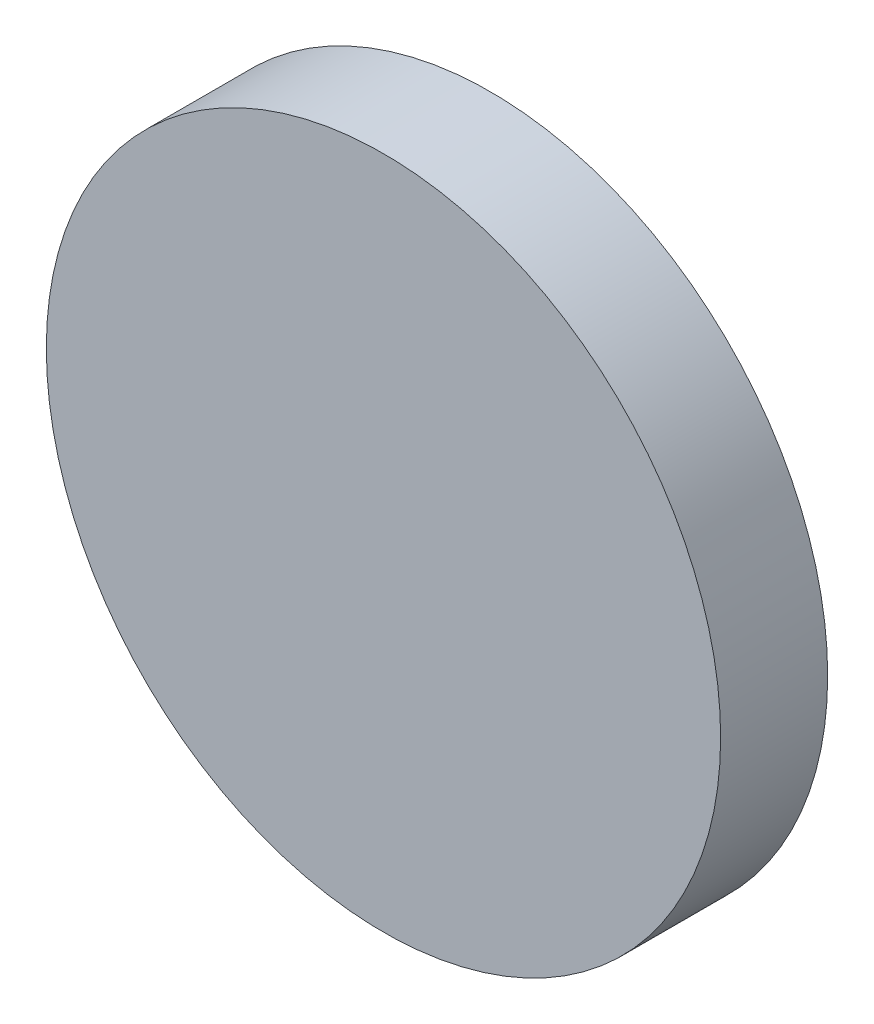
ISO-10303-21;
HEADER;
FILE_DESCRIPTION(('STEP AP214'),'2;1');
FILE_NAME('part.step','',(''),(''),'','','');
FILE_SCHEMA(('AUTOMOTIVE_DESIGN { 1 0 10303 214 1 1 1 1 }'));
ENDSEC;
DATA;
#1=APPLICATION_CONTEXT('core data for automotive mechanical design processes');
#2=APPLICATION_PROTOCOL_DEFINITION('international standard','automotive_design',2000,#1);
#3=PRODUCT_CONTEXT('',#1,'mechanical');
#4=PRODUCT('Part','Part','',(#3));
#5=PRODUCT_RELATED_PRODUCT_CATEGORY('part','',(#4));
#6=PRODUCT_DEFINITION_FORMATION('','',#4);
#7=PRODUCT_DEFINITION_CONTEXT('part definition',#1,'design');
#8=PRODUCT_DEFINITION('design','',#6,#7);
#9=PRODUCT_DEFINITION_SHAPE('','',#8);
#10=(LENGTH_UNIT() NAMED_UNIT(*) SI_UNIT(.MILLI.,.METRE.));
#11=(NAMED_UNIT(*) PLANE_ANGLE_UNIT() SI_UNIT($,.RADIAN.));
#12=(NAMED_UNIT(*) SI_UNIT($,.STERADIAN.) SOLID_ANGLE_UNIT());
#13=UNCERTAINTY_MEASURE_WITH_UNIT(LENGTH_MEASURE(1.E-05),#10,'distance_accuracy_value','');
#14=(GEOMETRIC_REPRESENTATION_CONTEXT(3) GLOBAL_UNCERTAINTY_ASSIGNED_CONTEXT((#13)) GLOBAL_UNIT_ASSIGNED_CONTEXT((#10,
#11,#12)) REPRESENTATION_CONTEXT('',''));
#15=CARTESIAN_POINT('',(0.,0.,0.));
#16=DIRECTION('',(0.,0.,1.));
#17=DIRECTION('',(1.,0.,0.));
#18=AXIS2_PLACEMENT_3D('',#15,#16,#17);
#19=CARTESIAN_POINT('',(0.,0.,1.));
#20=DIRECTION('',(0.,0.,-1.));
#21=DIRECTION('',(-1.,0.,0.));
#22=AXIS2_PLACEMENT_3D('',#19,#20,#21);
#23=CYLINDRICAL_SURFACE('',#22,3.15);
#24=CARTESIAN_POINT('',(0.,0.,1.));
#25=DIRECTION('',(0.,0.,1.));
#26=DIRECTION('',(1.,0.,0.));
#27=AXIS2_PLACEMENT_3D('',#24,#25,#26);
#28=CIRCLE('',#27,3.15);
#29=CARTESIAN_POINT('',(3.15,0.,1.));
#30=VERTEX_POINT('',#29);
#31=EDGE_CURVE('E10',#30,#30,#28,.T.);
#32=ORIENTED_EDGE('',*,*,#31,.F.);
#33=EDGE_LOOP('',(#32));
#34=FACE_BOUND('',#33,.T.);
#35=CARTESIAN_POINT('',(0.,0.,0.));
#36=DIRECTION('',(0.,0.,1.));
#37=DIRECTION('',(1.,0.,0.));
#38=AXIS2_PLACEMENT_3D('',#35,#36,#37);
#39=CIRCLE('',#38,3.15);
#40=CARTESIAN_POINT('',(3.15,0.,0.));
#41=VERTEX_POINT('',#40);
#42=EDGE_CURVE('E38',#41,#41,#39,.T.);
#43=ORIENTED_EDGE('',*,*,#42,.T.);
#44=EDGE_LOOP('',(#43));
#45=FACE_BOUND('',#44,.T.);
#46=ADVANCED_FACE('F35',(#34,#45),#23,.T.);
#47=CARTESIAN_POINT('',(0.,0.,1.));
#48=DIRECTION('',(0.,0.,1.));
#49=DIRECTION('',(1.,0.,0.));
#50=AXIS2_PLACEMENT_3D('',#47,#48,#49);
#51=PLANE('',#50);
#52=ORIENTED_EDGE('',*,*,#31,.T.);
#53=EDGE_LOOP('',(#52));
#54=FACE_BOUND('',#53,.T.);
#55=ADVANCED_FACE('F50',(#54),#51,.T.);
#56=CARTESIAN_POINT('',(0.,0.,0.));
#57=DIRECTION('',(0.,0.,1.));
#58=DIRECTION('',(1.,0.,0.));
#59=AXIS2_PLACEMENT_3D('',#56,#57,#58);
#60=PLANE('',#59);
#61=ORIENTED_EDGE('',*,*,#42,.F.);
#62=EDGE_LOOP('',(#61));
#63=FACE_BOUND('',#62,.T.);
#64=ADVANCED_FACE('F48',(#63),#60,.F.);
#65=CLOSED_SHELL('',(#46,#55,#64));
#66=MANIFOLD_SOLID_BREP('B2',#65);
#67=ADVANCED_BREP_SHAPE_REPRESENTATION('',(#18,#66),#14);
#68=SHAPE_DEFINITION_REPRESENTATION(#9,#67);
ENDSEC;
END-ISO-10303-21;
